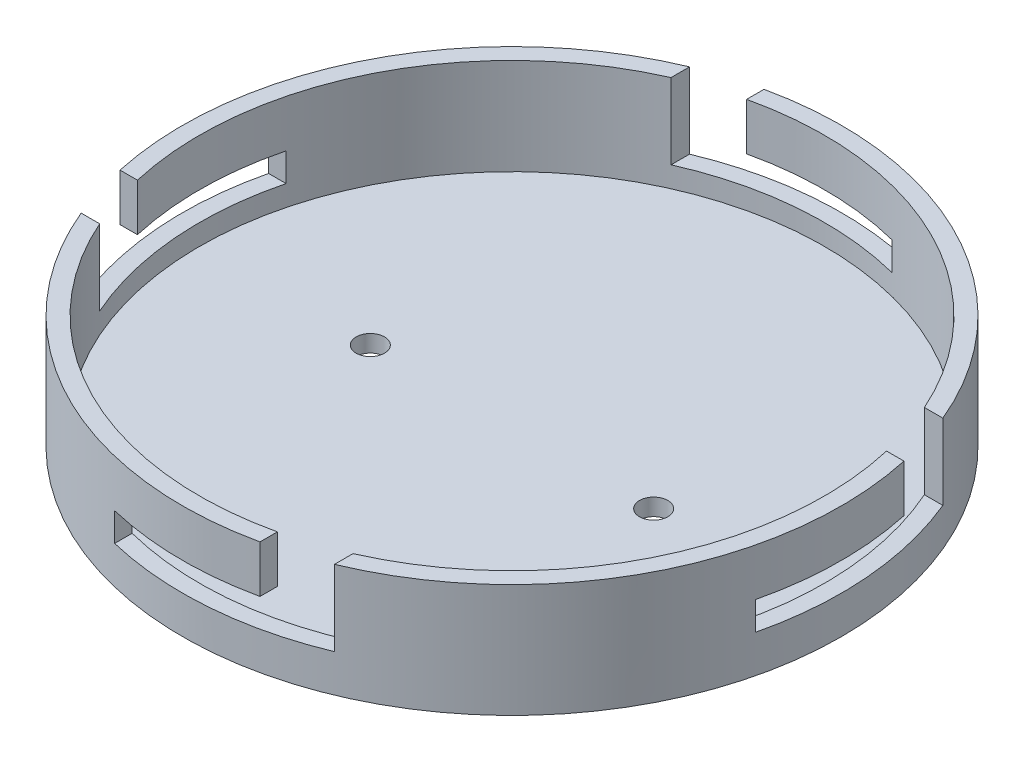
ISO-10303-21;
HEADER;
FILE_DESCRIPTION(('STEP AP214'),'2;1');
FILE_NAME('part.step','',(''),(''),'','','');
FILE_SCHEMA(('AUTOMOTIVE_DESIGN { 1 0 10303 214 1 1 1 1 }'));
ENDSEC;
DATA;
#1=APPLICATION_CONTEXT('core data for automotive mechanical design processes');
#2=APPLICATION_PROTOCOL_DEFINITION('international standard','automotive_design',2000,#1);
#3=PRODUCT_CONTEXT('',#1,'mechanical');
#4=PRODUCT('Part','Part','',(#3));
#5=PRODUCT_RELATED_PRODUCT_CATEGORY('part','',(#4));
#6=PRODUCT_DEFINITION_FORMATION('','',#4);
#7=PRODUCT_DEFINITION_CONTEXT('part definition',#1,'design');
#8=PRODUCT_DEFINITION('design','',#6,#7);
#9=PRODUCT_DEFINITION_SHAPE('','',#8);
#10=(LENGTH_UNIT() NAMED_UNIT(*) SI_UNIT(.MILLI.,.METRE.));
#11=(NAMED_UNIT(*) PLANE_ANGLE_UNIT() SI_UNIT($,.RADIAN.));
#12=(NAMED_UNIT(*) SI_UNIT($,.STERADIAN.) SOLID_ANGLE_UNIT());
#13=UNCERTAINTY_MEASURE_WITH_UNIT(LENGTH_MEASURE(1.E-05),#10,'distance_accuracy_value','');
#14=(GEOMETRIC_REPRESENTATION_CONTEXT(3) GLOBAL_UNCERTAINTY_ASSIGNED_CONTEXT((#13)) GLOBAL_UNIT_ASSIGNED_CONTEXT((#10,
#11,#12)) REPRESENTATION_CONTEXT('',''));
#15=CARTESIAN_POINT('',(0.,0.,0.));
#16=DIRECTION('',(0.,0.,1.));
#17=DIRECTION('',(1.,0.,0.));
#18=AXIS2_PLACEMENT_3D('',#15,#16,#17);
#19=CARTESIAN_POINT('',(0.,20.,0.));
#20=DIRECTION('',(0.,1.,0.));
#21=DIRECTION('',(0.,0.,1.));
#22=AXIS2_PLACEMENT_3D('',#19,#20,#21);
#23=PLANE('',#22);
#24=CARTESIAN_POINT('',(0.,20.,0.));
#25=DIRECTION('',(0.,1.,0.));
#26=DIRECTION('',(1.,0.,0.));
#27=AXIS2_PLACEMENT_3D('',#24,#25,#26);
#28=CIRCLE('',#27,58.1543289325507);
#29=CARTESIAN_POINT('',(53.6880826962519,20.,-22.3498489926829));
#30=VERTEX_POINT('',#29);
#31=CARTESIAN_POINT('',(-12.3498489926827,20.,-56.8278734729115));
#32=VERTEX_POINT('',#31);
#33=EDGE_CURVE('E240',#30,#32,#28,.T.);
#34=ORIENTED_EDGE('',*,*,#33,.T.);
#35=DIRECTION('',(0.,0.,1.));
#36=VECTOR('',#35,1.);
#37=CARTESIAN_POINT('',(-12.3498489926827,20.,-58.154328932551));
#38=LINE('',#37,#36);
#39=CARTESIAN_POINT('',(-12.3498489926827,20.,-53.7538950203419));
#40=VERTEX_POINT('',#39);
#41=EDGE_CURVE('E323',#32,#40,#38,.T.);
#42=ORIENTED_EDGE('',*,*,#41,.T.);
#43=CARTESIAN_POINT('',(0.,20.,0.));
#44=DIRECTION('',(0.,1.,0.));
#45=DIRECTION('',(0.,0.,1.));
#46=AXIS2_PLACEMENT_3D('',#43,#44,#45);
#47=CIRCLE('',#46,55.1543289325507);
#48=CARTESIAN_POINT('',(50.4230527636345,20.,-22.3498489926829));
#49=VERTEX_POINT('',#48);
#50=EDGE_CURVE('E403',#49,#40,#47,.T.);
#51=ORIENTED_EDGE('',*,*,#50,.F.);
#52=DIRECTION('',(-1.,0.,0.));
#53=VECTOR('',#52,1.);
#54=CARTESIAN_POINT('',(58.1543289325507,20.,-22.3498489926829));
#55=LINE('',#54,#53);
#56=EDGE_CURVE('E334',#30,#49,#55,.T.);
#57=ORIENTED_EDGE('',*,*,#56,.F.);
#58=EDGE_LOOP('',(#34,#42,#51,#57));
#59=FACE_BOUND('',#58,.T.);
#60=ADVANCED_FACE('F41',(#59),#23,.T.);
#61=CARTESIAN_POINT('',(22.3498489926823,20.,53.6880826962521));
#62=VERTEX_POINT('',#61);
#63=CARTESIAN_POINT('',(56.8278734729115,20.,-12.3498489926829));
#64=VERTEX_POINT('',#63);
#65=EDGE_CURVE('E233',#62,#64,#28,.T.);
#66=ORIENTED_EDGE('',*,*,#65,.T.);
#67=DIRECTION('',(-1.,0.,0.));
#68=VECTOR('',#67,1.);
#69=CARTESIAN_POINT('',(58.1543289325507,20.,-12.3498489926829));
#70=LINE('',#69,#68);
#71=CARTESIAN_POINT('',(53.7538950203418,20.,-12.3498489926829));
#72=VERTEX_POINT('',#71);
#73=EDGE_CURVE('E336',#64,#72,#70,.T.);
#74=ORIENTED_EDGE('',*,*,#73,.T.);
#75=CARTESIAN_POINT('',(22.3498489926823,20.,50.4230527636348));
#76=VERTEX_POINT('',#75);
#77=EDGE_CURVE('E254',#76,#72,#47,.T.);
#78=ORIENTED_EDGE('',*,*,#77,.F.);
#79=DIRECTION('',(0.,0.,-1.));
#80=VECTOR('',#79,1.);
#81=CARTESIAN_POINT('',(22.3498489926822,20.,58.1543289325516));
#82=LINE('',#81,#80);
#83=EDGE_CURVE('E215',#62,#76,#82,.T.);
#84=ORIENTED_EDGE('',*,*,#83,.F.);
#85=EDGE_LOOP('',(#66,#74,#78,#84));
#86=FACE_BOUND('',#85,.T.);
#87=ADVANCED_FACE('F414',(#86),#23,.T.);
#88=CARTESIAN_POINT('',(-53.6880826962519,20.,22.3498489926829));
#89=VERTEX_POINT('',#88);
#90=CARTESIAN_POINT('',(12.3498489926823,20.,56.8278734729116));
#91=VERTEX_POINT('',#90);
#92=EDGE_CURVE('E223',#89,#91,#28,.T.);
#93=ORIENTED_EDGE('',*,*,#92,.T.);
#94=DIRECTION('',(0.,0.,-1.));
#95=VECTOR('',#94,1.);
#96=CARTESIAN_POINT('',(12.3498489926822,20.,58.1543289325515));
#97=LINE('',#96,#95);
#98=CARTESIAN_POINT('',(12.3498489926823,20.,53.753895020342));
#99=VERTEX_POINT('',#98);
#100=EDGE_CURVE('E203',#91,#99,#97,.T.);
#101=ORIENTED_EDGE('',*,*,#100,.T.);
#102=CARTESIAN_POINT('',(-50.4230527636345,20.,22.3498489926829));
#103=VERTEX_POINT('',#102);
#104=EDGE_CURVE('E251',#103,#99,#47,.T.);
#105=ORIENTED_EDGE('',*,*,#104,.F.);
#106=DIRECTION('',(1.,0.,0.));
#107=VECTOR('',#106,1.);
#108=CARTESIAN_POINT('',(-58.1543289325507,20.,22.3498489926829));
#109=LINE('',#108,#107);
#110=EDGE_CURVE('E231',#89,#103,#109,.T.);
#111=ORIENTED_EDGE('',*,*,#110,.F.);
#112=EDGE_LOOP('',(#93,#101,#105,#111));
#113=FACE_BOUND('',#112,.T.);
#114=ADVANCED_FACE('F230',(#113),#23,.T.);
#115=CARTESIAN_POINT('',(0.,20.,0.));
#116=DIRECTION('',(0.,-1.,0.));
#117=DIRECTION('',(0.,0.,-1.));
#118=AXIS2_PLACEMENT_3D('',#115,#116,#117);
#119=CYLINDRICAL_SURFACE('',#118,58.1543289325507);
#120=CARTESIAN_POINT('',(0.,0.,0.));
#121=DIRECTION('',(0.,1.,0.));
#122=DIRECTION('',(1.,0.,0.));
#123=AXIS2_PLACEMENT_3D('',#120,#121,#122);
#124=CIRCLE('',#123,58.1543289325507);
#125=CARTESIAN_POINT('',(58.1543289325507,0.,0.));
#126=VERTEX_POINT('',#125);
#127=EDGE_CURVE('E243',#126,#126,#124,.T.);
#128=ORIENTED_EDGE('',*,*,#127,.T.);
#129=EDGE_LOOP('',(#128));
#130=FACE_BOUND('',#129,.T.);
#131=CARTESIAN_POINT('',(0.,11.6584784594273,0.));
#132=DIRECTION('',(0.,-1.,0.));
#133=DIRECTION('',(0.,0.,-1.));
#134=AXIS2_PLACEMENT_3D('',#131,#132,#133);
#135=CIRCLE('',#134,58.1543289325507);
#136=CARTESIAN_POINT('',(-12.3498489926827,11.6584784594273,-56.8278734729115));
#137=VERTEX_POINT('',#136);
#138=CARTESIAN_POINT('',(13.5852023288859,11.6584784594273,-56.5452761181563));
#139=VERTEX_POINT('',#138);
#140=EDGE_CURVE('E369',#137,#139,#135,.T.);
#141=ORIENTED_EDGE('',*,*,#140,.F.);
#142=DIRECTION('',(0.,-1.,0.));
#143=VECTOR('',#142,1.);
#144=CARTESIAN_POINT('',(-12.3498489926827,20.,-56.8278734729115));
#145=LINE('',#144,#143);
#146=EDGE_CURVE('E372',#32,#137,#145,.T.);
#147=ORIENTED_EDGE('',*,*,#146,.F.);
#148=ORIENTED_EDGE('',*,*,#33,.F.);
#149=DIRECTION('',(0.,-1.,0.));
#150=VECTOR('',#149,1.);
#151=CARTESIAN_POINT('',(53.6880826962519,20.,-22.3498489926829));
#152=LINE('',#151,#150);
#153=CARTESIAN_POINT('',(53.6880826962519,6.65847845942732,-22.3498489926829));
#154=VERTEX_POINT('',#153);
#155=EDGE_CURVE('E356',#30,#154,#152,.T.);
#156=ORIENTED_EDGE('',*,*,#155,.T.);
#157=CARTESIAN_POINT('',(0.,6.65847845942732,0.));
#158=DIRECTION('',(0.,-1.,0.));
#159=DIRECTION('',(0.,0.,-1.));
#160=AXIS2_PLACEMENT_3D('',#157,#158,#159);
#161=CIRCLE('',#160,58.1543289325507);
#162=CARTESIAN_POINT('',(56.5452761181564,6.65847845942732,13.5852023288857));
#163=VERTEX_POINT('',#162);
#164=EDGE_CURVE('E365',#154,#163,#161,.T.);
#165=ORIENTED_EDGE('',*,*,#164,.T.);
#166=DIRECTION('',(0.,-1.,0.));
#167=VECTOR('',#166,1.);
#168=CARTESIAN_POINT('',(56.5452761181564,20.,13.5852023288857));
#169=LINE('',#168,#167);
#170=CARTESIAN_POINT('',(56.5452761181564,11.6584784594273,13.5852023288857));
#171=VERTEX_POINT('',#170);
#172=EDGE_CURVE('E352',#163,#171,#169,.F.);
#173=ORIENTED_EDGE('',*,*,#172,.T.);
#174=CARTESIAN_POINT('',(56.8278734729115,11.6584784594273,-12.3498489926829));
#175=VERTEX_POINT('',#174);
#176=EDGE_CURVE('E370',#175,#171,#135,.T.);
#177=ORIENTED_EDGE('',*,*,#176,.F.);
#178=DIRECTION('',(0.,-1.,0.));
#179=VECTOR('',#178,1.);
#180=CARTESIAN_POINT('',(56.8278734729115,20.,-12.3498489926829));
#181=LINE('',#180,#179);
#182=EDGE_CURVE('E322',#64,#175,#181,.T.);
#183=ORIENTED_EDGE('',*,*,#182,.F.);
#184=ORIENTED_EDGE('',*,*,#65,.F.);
#185=DIRECTION('',(0.,-1.,0.));
#186=VECTOR('',#185,1.);
#187=CARTESIAN_POINT('',(22.3498489926823,20.,53.6880826962521));
#188=LINE('',#187,#186);
#189=CARTESIAN_POINT('',(22.3498489926823,6.65847845942732,53.6880826962521));
#190=VERTEX_POINT('',#189);
#191=EDGE_CURVE('E226',#62,#190,#188,.T.);
#192=ORIENTED_EDGE('',*,*,#191,.T.);
#193=CARTESIAN_POINT('',(-13.5852023288863,6.65847845942732,56.5452761181562));
#194=VERTEX_POINT('',#193);
#195=EDGE_CURVE('E364',#190,#194,#161,.T.);
#196=ORIENTED_EDGE('',*,*,#195,.T.);
#197=DIRECTION('',(0.,-1.,0.));
#198=VECTOR('',#197,1.);
#199=CARTESIAN_POINT('',(-13.5852023288863,20.,56.5452761181562));
#200=LINE('',#199,#198);
#201=CARTESIAN_POINT('',(-13.5852023288863,11.6584784594273,56.5452761181562));
#202=VERTEX_POINT('',#201);
#203=EDGE_CURVE('E227',#194,#202,#200,.F.);
#204=ORIENTED_EDGE('',*,*,#203,.T.);
#205=CARTESIAN_POINT('',(12.3498489926823,11.6584784594273,56.8278734729116));
#206=VERTEX_POINT('',#205);
#207=EDGE_CURVE('E225',#206,#202,#135,.T.);
#208=ORIENTED_EDGE('',*,*,#207,.F.);
#209=DIRECTION('',(0.,-1.,0.));
#210=VECTOR('',#209,1.);
#211=CARTESIAN_POINT('',(12.3498489926823,20.,56.8278734729116));
#212=LINE('',#211,#210);
#213=EDGE_CURVE('E207',#91,#206,#212,.T.);
#214=ORIENTED_EDGE('',*,*,#213,.F.);
#215=ORIENTED_EDGE('',*,*,#92,.F.);
#216=DIRECTION('',(0.,-1.,0.));
#217=VECTOR('',#216,1.);
#218=CARTESIAN_POINT('',(-53.6880826962519,20.,22.3498489926829));
#219=LINE('',#218,#217);
#220=CARTESIAN_POINT('',(-53.6880826962519,6.65847845942732,22.3498489926829));
#221=VERTEX_POINT('',#220);
#222=EDGE_CURVE('E379',#89,#221,#219,.T.);
#223=ORIENTED_EDGE('',*,*,#222,.T.);
#224=CARTESIAN_POINT('',(0.,6.65847845942732,0.));
#225=DIRECTION('',(0.,-1.,0.));
#226=DIRECTION('',(0.,0.,-1.));
#227=AXIS2_PLACEMENT_3D('',#224,#225,#226);
#228=CIRCLE('',#227,58.1543289325507);
#229=CARTESIAN_POINT('',(-56.5452761181564,6.65847845942732,-13.5852023288857));
#230=VERTEX_POINT('',#229);
#231=EDGE_CURVE('E392',#221,#230,#228,.T.);
#232=ORIENTED_EDGE('',*,*,#231,.T.);
#233=DIRECTION('',(0.,-1.,0.));
#234=VECTOR('',#233,1.);
#235=CARTESIAN_POINT('',(-56.5452761181564,20.,-13.5852023288857));
#236=LINE('',#235,#234);
#237=CARTESIAN_POINT('',(-56.5452761181564,11.6584784594273,-13.5852023288857));
#238=VERTEX_POINT('',#237);
#239=EDGE_CURVE('E394',#230,#238,#236,.F.);
#240=ORIENTED_EDGE('',*,*,#239,.T.);
#241=CARTESIAN_POINT('',(0.,11.6584784594273,0.));
#242=DIRECTION('',(0.,-1.,0.));
#243=DIRECTION('',(0.,0.,-1.));
#244=AXIS2_PLACEMENT_3D('',#241,#242,#243);
#245=CIRCLE('',#244,58.1543289325507);
#246=CARTESIAN_POINT('',(-56.8278734729115,11.6584784594273,12.3498489926829));
#247=VERTEX_POINT('',#246);
#248=EDGE_CURVE('E397',#247,#238,#245,.T.);
#249=ORIENTED_EDGE('',*,*,#248,.F.);
#250=DIRECTION('',(0.,-1.,0.));
#251=VECTOR('',#250,1.);
#252=CARTESIAN_POINT('',(-56.8278734729115,20.,12.3498489926829));
#253=LINE('',#252,#251);
#254=CARTESIAN_POINT('',(-56.8278734729115,20.,12.3498489926829));
#255=VERTEX_POINT('',#254);
#256=EDGE_CURVE('E399',#255,#247,#253,.T.);
#257=ORIENTED_EDGE('',*,*,#256,.F.);
#258=CARTESIAN_POINT('',(-22.3498489926827,20.,-53.6880826962519));
#259=VERTEX_POINT('',#258);
#260=EDGE_CURVE('E235',#259,#255,#28,.T.);
#261=ORIENTED_EDGE('',*,*,#260,.F.);
#262=DIRECTION('',(0.,-1.,0.));
#263=VECTOR('',#262,1.);
#264=CARTESIAN_POINT('',(-22.3498489926827,20.,-53.6880826962519));
#265=LINE('',#264,#263);
#266=CARTESIAN_POINT('',(-22.3498489926827,6.65847845942732,-53.6880826962519));
#267=VERTEX_POINT('',#266);
#268=EDGE_CURVE('E359',#259,#267,#265,.T.);
#269=ORIENTED_EDGE('',*,*,#268,.T.);
#270=CARTESIAN_POINT('',(13.5852023288859,6.65847845942732,-56.5452761181563));
#271=VERTEX_POINT('',#270);
#272=EDGE_CURVE('E362',#267,#271,#161,.T.);
#273=ORIENTED_EDGE('',*,*,#272,.T.);
#274=DIRECTION('',(0.,-1.,0.));
#275=VECTOR('',#274,1.);
#276=CARTESIAN_POINT('',(13.5852023288859,20.,-56.5452761181563));
#277=LINE('',#276,#275);
#278=EDGE_CURVE('E366',#271,#139,#277,.F.);
#279=ORIENTED_EDGE('',*,*,#278,.T.);
#280=EDGE_LOOP('',(#141,#147,#148,#156,#165,#173,#177,#183,#184,#192,#196,#204,#208,#214,#215,
#223,#232,#240,#249,#257,#261,#269,#273,#279));
#281=FACE_BOUND('',#280,.T.);
#282=ADVANCED_FACE('F221',(#130,#281),#119,.T.);
#283=CARTESIAN_POINT('',(0.,20.,0.));
#284=DIRECTION('',(0.,-1.,0.));
#285=DIRECTION('',(0.,0.,-1.));
#286=AXIS2_PLACEMENT_3D('',#283,#284,#285);
#287=CYLINDRICAL_SURFACE('',#286,55.1543289325507);
#288=CARTESIAN_POINT('',(0.,3.,0.));
#289=DIRECTION('',(0.,1.,0.));
#290=DIRECTION('',(0.,0.,1.));
#291=AXIS2_PLACEMENT_3D('',#288,#289,#290);
#292=CIRCLE('',#291,55.1543289325507);
#293=CARTESIAN_POINT('',(0.,3.,55.1543289325507));
#294=VERTEX_POINT('',#293);
#295=EDGE_CURVE('E232',#294,#294,#292,.F.);
#296=ORIENTED_EDGE('',*,*,#295,.T.);
#297=EDGE_LOOP('',(#296));
#298=FACE_BOUND('',#297,.T.);
#299=ORIENTED_EDGE('',*,*,#50,.T.);
#300=DIRECTION('',(0.,-1.,0.));
#301=VECTOR('',#300,1.);
#302=CARTESIAN_POINT('',(-12.3498489926827,20.,-53.7538950203419));
#303=LINE('',#302,#301);
#304=CARTESIAN_POINT('',(-12.3498489926827,11.6584784594273,-53.7538950203419));
#305=VERTEX_POINT('',#304);
#306=EDGE_CURVE('E12',#40,#305,#303,.T.);
#307=ORIENTED_EDGE('',*,*,#306,.T.);
#308=CARTESIAN_POINT('',(0.,11.6584784594273,0.));
#309=DIRECTION('',(0.,-1.,0.));
#310=DIRECTION('',(0.,0.,-1.));
#311=AXIS2_PLACEMENT_3D('',#308,#309,#310);
#312=CIRCLE('',#311,55.1543289325507);
#313=CARTESIAN_POINT('',(13.5852023288859,11.6584784594273,-53.4550491318008));
#314=VERTEX_POINT('',#313);
#315=EDGE_CURVE('E49',#305,#314,#312,.T.);
#316=ORIENTED_EDGE('',*,*,#315,.T.);
#317=DIRECTION('',(0.,-1.,0.));
#318=VECTOR('',#317,1.);
#319=CARTESIAN_POINT('',(13.5852023288859,20.,-53.4550491318008));
#320=LINE('',#319,#318);
#321=CARTESIAN_POINT('',(13.5852023288859,6.65847845942732,-53.4550491318008));
#322=VERTEX_POINT('',#321);
#323=EDGE_CURVE('E289',#322,#314,#320,.F.);
#324=ORIENTED_EDGE('',*,*,#323,.F.);
#325=CARTESIAN_POINT('',(0.,6.65847845942732,0.));
#326=DIRECTION('',(0.,-1.,0.));
#327=DIRECTION('',(0.,0.,-1.));
#328=AXIS2_PLACEMENT_3D('',#325,#326,#327);
#329=CIRCLE('',#328,55.1543289325507);
#330=CARTESIAN_POINT('',(-22.3498489926827,6.65847845942732,-50.4230527636346));
#331=VERTEX_POINT('',#330);
#332=EDGE_CURVE('E273',#331,#322,#329,.T.);
#333=ORIENTED_EDGE('',*,*,#332,.F.);
#334=DIRECTION('',(0.,-1.,0.));
#335=VECTOR('',#334,1.);
#336=CARTESIAN_POINT('',(-22.3498489926827,20.,-50.4230527636346));
#337=LINE('',#336,#335);
#338=CARTESIAN_POINT('',(-22.3498489926827,20.,-50.4230527636346));
#339=VERTEX_POINT('',#338);
#340=EDGE_CURVE('E288',#339,#331,#337,.T.);
#341=ORIENTED_EDGE('',*,*,#340,.F.);
#342=CARTESIAN_POINT('',(-53.7538950203418,20.,12.3498489926829));
#343=VERTEX_POINT('',#342);
#344=EDGE_CURVE('E255',#339,#343,#47,.T.);
#345=ORIENTED_EDGE('',*,*,#344,.T.);
#346=DIRECTION('',(0.,-1.,0.));
#347=VECTOR('',#346,1.);
#348=CARTESIAN_POINT('',(-53.7538950203418,20.,12.3498489926829));
#349=LINE('',#348,#347);
#350=CARTESIAN_POINT('',(-53.7538950203418,11.6584784594273,12.3498489926829));
#351=VERTEX_POINT('',#350);
#352=EDGE_CURVE('E265',#343,#351,#349,.T.);
#353=ORIENTED_EDGE('',*,*,#352,.T.);
#354=CARTESIAN_POINT('',(0.,11.6584784594273,0.));
#355=DIRECTION('',(0.,-1.,0.));
#356=DIRECTION('',(0.,0.,-1.));
#357=AXIS2_PLACEMENT_3D('',#354,#355,#356);
#358=CIRCLE('',#357,55.1543289325507);
#359=CARTESIAN_POINT('',(-53.4550491318008,11.6584784594273,-13.5852023288857));
#360=VERTEX_POINT('',#359);
#361=EDGE_CURVE('E262',#351,#360,#358,.T.);
#362=ORIENTED_EDGE('',*,*,#361,.T.);
#363=DIRECTION('',(0.,-1.,0.));
#364=VECTOR('',#363,1.);
#365=CARTESIAN_POINT('',(-53.4550491318008,20.,-13.5852023288857));
#366=LINE('',#365,#364);
#367=CARTESIAN_POINT('',(-53.4550491318008,6.65847845942732,-13.5852023288857));
#368=VERTEX_POINT('',#367);
#369=EDGE_CURVE('E260',#368,#360,#366,.F.);
#370=ORIENTED_EDGE('',*,*,#369,.F.);
#371=CARTESIAN_POINT('',(0.,6.65847845942732,0.));
#372=DIRECTION('',(0.,-1.,0.));
#373=DIRECTION('',(0.,0.,-1.));
#374=AXIS2_PLACEMENT_3D('',#371,#372,#373);
#375=CIRCLE('',#374,55.1543289325507);
#376=CARTESIAN_POINT('',(-50.4230527636345,6.65847845942732,22.3498489926829));
#377=VERTEX_POINT('',#376);
#378=EDGE_CURVE('E258',#377,#368,#375,.T.);
#379=ORIENTED_EDGE('',*,*,#378,.F.);
#380=DIRECTION('',(0.,-1.,0.));
#381=VECTOR('',#380,1.);
#382=CARTESIAN_POINT('',(-50.4230527636345,20.,22.3498489926829));
#383=LINE('',#382,#381);
#384=EDGE_CURVE('E237',#103,#377,#383,.T.);
#385=ORIENTED_EDGE('',*,*,#384,.F.);
#386=ORIENTED_EDGE('',*,*,#104,.T.);
#387=DIRECTION('',(0.,-1.,0.));
#388=VECTOR('',#387,1.);
#389=CARTESIAN_POINT('',(12.3498489926823,20.,53.753895020342));
#390=LINE('',#389,#388);
#391=CARTESIAN_POINT('',(12.3498489926823,11.6584784594273,53.753895020342));
#392=VERTEX_POINT('',#391);
#393=EDGE_CURVE('E210',#99,#392,#390,.T.);
#394=ORIENTED_EDGE('',*,*,#393,.T.);
#395=CARTESIAN_POINT('',(-13.5852023288862,11.6584784594273,53.4550491318007));
#396=VERTEX_POINT('',#395);
#397=EDGE_CURVE('E272',#392,#396,#312,.T.);
#398=ORIENTED_EDGE('',*,*,#397,.T.);
#399=DIRECTION('',(0.,-1.,0.));
#400=VECTOR('',#399,1.);
#401=CARTESIAN_POINT('',(-13.5852023288862,20.,53.4550491318007));
#402=LINE('',#401,#400);
#403=CARTESIAN_POINT('',(-13.5852023288862,6.65847845942732,53.4550491318007));
#404=VERTEX_POINT('',#403);
#405=EDGE_CURVE('E268',#404,#396,#402,.F.);
#406=ORIENTED_EDGE('',*,*,#405,.F.);
#407=CARTESIAN_POINT('',(22.3498489926823,6.65847845942732,50.4230527636348));
#408=VERTEX_POINT('',#407);
#409=EDGE_CURVE('E270',#408,#404,#329,.T.);
#410=ORIENTED_EDGE('',*,*,#409,.F.);
#411=DIRECTION('',(0.,-1.,0.));
#412=VECTOR('',#411,1.);
#413=CARTESIAN_POINT('',(22.3498489926823,20.,50.4230527636348));
#414=LINE('',#413,#412);
#415=EDGE_CURVE('E279',#76,#408,#414,.T.);
#416=ORIENTED_EDGE('',*,*,#415,.F.);
#417=ORIENTED_EDGE('',*,*,#77,.T.);
#418=DIRECTION('',(0.,-1.,0.));
#419=VECTOR('',#418,1.);
#420=CARTESIAN_POINT('',(53.7538950203418,20.,-12.3498489926829));
#421=LINE('',#420,#419);
#422=CARTESIAN_POINT('',(53.7538950203418,11.6584784594273,-12.3498489926829));
#423=VERTEX_POINT('',#422);
#424=EDGE_CURVE('E283',#72,#423,#421,.T.);
#425=ORIENTED_EDGE('',*,*,#424,.T.);
#426=CARTESIAN_POINT('',(53.4550491318008,11.6584784594273,13.5852023288857));
#427=VERTEX_POINT('',#426);
#428=EDGE_CURVE('E277',#423,#427,#312,.T.);
#429=ORIENTED_EDGE('',*,*,#428,.T.);
#430=DIRECTION('',(0.,-1.,0.));
#431=VECTOR('',#430,1.);
#432=CARTESIAN_POINT('',(53.4550491318008,20.,13.5852023288857));
#433=LINE('',#432,#431);
#434=CARTESIAN_POINT('',(53.4550491318008,6.65847845942732,13.5852023288857));
#435=VERTEX_POINT('',#434);
#436=EDGE_CURVE('E281',#435,#427,#433,.F.);
#437=ORIENTED_EDGE('',*,*,#436,.F.);
#438=CARTESIAN_POINT('',(50.4230527636345,6.65847845942732,-22.3498489926829));
#439=VERTEX_POINT('',#438);
#440=EDGE_CURVE('E274',#439,#435,#329,.T.);
#441=ORIENTED_EDGE('',*,*,#440,.F.);
#442=DIRECTION('',(0.,-1.,0.));
#443=VECTOR('',#442,1.);
#444=CARTESIAN_POINT('',(50.4230527636345,20.,-22.3498489926829));
#445=LINE('',#444,#443);
#446=EDGE_CURVE('E286',#49,#439,#445,.T.);
#447=ORIENTED_EDGE('',*,*,#446,.F.);
#448=EDGE_LOOP('',(#299,#307,#316,#324,#333,#341,#345,#353,#362,#370,#379,#385,#386,#394,#398,
#406,#410,#416,#417,#425,#429,#437,#441,#447));
#449=FACE_BOUND('',#448,.T.);
#450=ADVANCED_FACE('F307',(#298,#449),#287,.F.);
#451=DIRECTION('',(0.,0.,1.));
#452=VECTOR('',#451,1.);
#453=CARTESIAN_POINT('',(-22.3498489926826,20.,-58.154328932551));
#454=LINE('',#453,#452);
#455=EDGE_CURVE('E326',#259,#339,#454,.T.);
#456=ORIENTED_EDGE('',*,*,#455,.F.);
#457=ORIENTED_EDGE('',*,*,#260,.T.);
#458=DIRECTION('',(1.,0.,0.));
#459=VECTOR('',#458,1.);
#460=CARTESIAN_POINT('',(-58.1543289325507,20.,12.3498489926829));
#461=LINE('',#460,#459);
#462=EDGE_CURVE('E375',#255,#343,#461,.T.);
#463=ORIENTED_EDGE('',*,*,#462,.T.);
#464=ORIENTED_EDGE('',*,*,#344,.F.);
#465=EDGE_LOOP('',(#456,#457,#463,#464));
#466=FACE_BOUND('',#465,.T.);
#467=ADVANCED_FACE('F436',(#466),#23,.T.);
#468=CARTESIAN_POINT('',(0.,3.,0.));
#469=DIRECTION('',(0.,1.,0.));
#470=DIRECTION('',(0.,0.,1.));
#471=AXIS2_PLACEMENT_3D('',#468,#469,#470);
#472=PLANE('',#471);
#473=CARTESIAN_POINT('',(-25.,3.,0.));
#474=DIRECTION('',(0.,1.,0.));
#475=DIRECTION('',(0.,0.,1.));
#476=AXIS2_PLACEMENT_3D('',#473,#474,#475);
#477=CIRCLE('',#476,2.5);
#478=CARTESIAN_POINT('',(-25.,3.,2.5));
#479=VERTEX_POINT('',#478);
#480=EDGE_CURVE('E720',#479,#479,#477,.T.);
#481=ORIENTED_EDGE('',*,*,#480,.F.);
#482=EDGE_LOOP('',(#481));
#483=FACE_BOUND('',#482,.T.);
#484=CARTESIAN_POINT('',(25.,3.,0.));
#485=DIRECTION('',(0.,1.,0.));
#486=DIRECTION('',(0.,0.,1.));
#487=AXIS2_PLACEMENT_3D('',#484,#485,#486);
#488=CIRCLE('',#487,2.5);
#489=CARTESIAN_POINT('',(25.,3.,2.5));
#490=VERTEX_POINT('',#489);
#491=EDGE_CURVE('E727',#490,#490,#488,.T.);
#492=ORIENTED_EDGE('',*,*,#491,.F.);
#493=EDGE_LOOP('',(#492));
#494=FACE_BOUND('',#493,.T.);
#495=ORIENTED_EDGE('',*,*,#295,.F.);
#496=EDGE_LOOP('',(#495));
#497=FACE_BOUND('',#496,.T.);
#498=ADVANCED_FACE('F473',(#483,#494,#497),#472,.T.);
#499=CARTESIAN_POINT('',(0.,0.,0.));
#500=DIRECTION('',(0.,1.,0.));
#501=DIRECTION('',(0.,0.,1.));
#502=AXIS2_PLACEMENT_3D('',#499,#500,#501);
#503=PLANE('',#502);
#504=CARTESIAN_POINT('',(-25.,0.,0.));
#505=DIRECTION('',(0.,1.,0.));
#506=DIRECTION('',(0.,0.,1.));
#507=AXIS2_PLACEMENT_3D('',#504,#505,#506);
#508=CIRCLE('',#507,2.5);
#509=CARTESIAN_POINT('',(-25.,0.,2.5));
#510=VERTEX_POINT('',#509);
#511=EDGE_CURVE('E216',#510,#510,#508,.F.);
#512=ORIENTED_EDGE('',*,*,#511,.F.);
#513=EDGE_LOOP('',(#512));
#514=FACE_BOUND('',#513,.T.);
#515=CARTESIAN_POINT('',(25.,0.,0.));
#516=DIRECTION('',(0.,1.,0.));
#517=DIRECTION('',(0.,0.,1.));
#518=AXIS2_PLACEMENT_3D('',#515,#516,#517);
#519=CIRCLE('',#518,2.5);
#520=CARTESIAN_POINT('',(25.,0.,2.5));
#521=VERTEX_POINT('',#520);
#522=EDGE_CURVE('E724',#521,#521,#519,.F.);
#523=ORIENTED_EDGE('',*,*,#522,.F.);
#524=EDGE_LOOP('',(#523));
#525=FACE_BOUND('',#524,.T.);
#526=ORIENTED_EDGE('',*,*,#127,.F.);
#527=EDGE_LOOP('',(#526));
#528=FACE_BOUND('',#527,.T.);
#529=ADVANCED_FACE('F43',(#514,#525,#528),#503,.F.);
#530=CARTESIAN_POINT('',(-58.1543289325507,0.,12.3498489926829));
#531=DIRECTION('',(0.,0.,1.));
#532=DIRECTION('',(0.,-1.,0.));
#533=AXIS2_PLACEMENT_3D('',#530,#531,#532);
#534=PLANE('',#533);
#535=ORIENTED_EDGE('',*,*,#256,.T.);
#536=DIRECTION('',(1.,0.,0.));
#537=VECTOR('',#536,1.);
#538=CARTESIAN_POINT('',(-58.1543289325507,11.6584784594273,12.3498489926829));
#539=LINE('',#538,#537);
#540=EDGE_CURVE('E376',#247,#351,#539,.T.);
#541=ORIENTED_EDGE('',*,*,#540,.T.);
#542=ORIENTED_EDGE('',*,*,#352,.F.);
#543=ORIENTED_EDGE('',*,*,#462,.F.);
#544=EDGE_LOOP('',(#535,#541,#542,#543));
#545=FACE_BOUND('',#544,.T.);
#546=ADVANCED_FACE('F437',(#545),#534,.T.);
#547=CARTESIAN_POINT('',(-58.1543289325507,11.6584784594273,0.));
#548=DIRECTION('',(0.,-1.,0.));
#549=DIRECTION('',(0.,0.,-1.));
#550=AXIS2_PLACEMENT_3D('',#547,#548,#549);
#551=PLANE('',#550);
#552=ORIENTED_EDGE('',*,*,#248,.T.);
#553=DIRECTION('',(1.,0.,0.));
#554=VECTOR('',#553,1.);
#555=CARTESIAN_POINT('',(-58.1543289325507,11.6584784594273,-13.5852023288857));
#556=LINE('',#555,#554);
#557=EDGE_CURVE('E380',#238,#360,#556,.T.);
#558=ORIENTED_EDGE('',*,*,#557,.T.);
#559=ORIENTED_EDGE('',*,*,#361,.F.);
#560=ORIENTED_EDGE('',*,*,#540,.F.);
#561=EDGE_LOOP('',(#552,#558,#559,#560));
#562=FACE_BOUND('',#561,.T.);
#563=ADVANCED_FACE('F442',(#562),#551,.T.);
#564=CARTESIAN_POINT('',(-58.1543289325507,0.,-13.5852023288857));
#565=DIRECTION('',(0.,0.,-1.));
#566=DIRECTION('',(-1.,0.,0.));
#567=AXIS2_PLACEMENT_3D('',#564,#565,#566);
#568=PLANE('',#567);
#569=DIRECTION('',(1.,0.,0.));
#570=VECTOR('',#569,1.);
#571=CARTESIAN_POINT('',(-58.1543289325507,6.65847845942732,-13.5852023288857));
#572=LINE('',#571,#570);
#573=EDGE_CURVE('E383',#230,#368,#572,.T.);
#574=ORIENTED_EDGE('',*,*,#573,.T.);
#575=ORIENTED_EDGE('',*,*,#369,.T.);
#576=ORIENTED_EDGE('',*,*,#557,.F.);
#577=ORIENTED_EDGE('',*,*,#239,.F.);
#578=EDGE_LOOP('',(#574,#575,#576,#577));
#579=FACE_BOUND('',#578,.T.);
#580=ADVANCED_FACE('F444',(#579),#568,.F.);
#581=CARTESIAN_POINT('',(-58.1543289325507,6.65847845942732,0.));
#582=DIRECTION('',(0.,-1.,0.));
#583=DIRECTION('',(0.,0.,-1.));
#584=AXIS2_PLACEMENT_3D('',#581,#582,#583);
#585=PLANE('',#584);
#586=DIRECTION('',(1.,0.,0.));
#587=VECTOR('',#586,1.);
#588=CARTESIAN_POINT('',(-58.1543289325507,6.65847845942732,22.3498489926829));
#589=LINE('',#588,#587);
#590=EDGE_CURVE('E386',#221,#377,#589,.T.);
#591=ORIENTED_EDGE('',*,*,#590,.T.);
#592=ORIENTED_EDGE('',*,*,#378,.T.);
#593=ORIENTED_EDGE('',*,*,#573,.F.);
#594=ORIENTED_EDGE('',*,*,#231,.F.);
#595=EDGE_LOOP('',(#591,#592,#593,#594));
#596=FACE_BOUND('',#595,.T.);
#597=ADVANCED_FACE('F450',(#596),#585,.F.);
#598=CARTESIAN_POINT('',(-58.1543289325507,0.,22.3498489926829));
#599=DIRECTION('',(0.,0.,1.));
#600=DIRECTION('',(1.,0.,0.));
#601=AXIS2_PLACEMENT_3D('',#598,#599,#600);
#602=PLANE('',#601);
#603=ORIENTED_EDGE('',*,*,#110,.T.);
#604=ORIENTED_EDGE('',*,*,#384,.T.);
#605=ORIENTED_EDGE('',*,*,#590,.F.);
#606=ORIENTED_EDGE('',*,*,#222,.F.);
#607=EDGE_LOOP('',(#603,#604,#605,#606));
#608=FACE_BOUND('',#607,.T.);
#609=ADVANCED_FACE('F453',(#608),#602,.F.);
#610=CARTESIAN_POINT('',(-13.5852023288863,0.,58.1543289325512));
#611=DIRECTION('',(-1.,0.,0.));
#612=DIRECTION('',(0.,0.,1.));
#613=AXIS2_PLACEMENT_3D('',#610,#611,#612);
#614=PLANE('',#613);
#615=DIRECTION('',(0.,0.,-1.));
#616=VECTOR('',#615,1.);
#617=CARTESIAN_POINT('',(-13.5852023288863,6.65847845942732,58.1543289325512));
#618=LINE('',#617,#616);
#619=EDGE_CURVE('E64',#194,#404,#618,.T.);
#620=ORIENTED_EDGE('',*,*,#619,.T.);
#621=ORIENTED_EDGE('',*,*,#405,.T.);
#622=DIRECTION('',(0.,0.,-1.));
#623=VECTOR('',#622,1.);
#624=CARTESIAN_POINT('',(-13.5852023288863,11.6584784594273,58.1543289325512));
#625=LINE('',#624,#623);
#626=EDGE_CURVE('E733',#202,#396,#625,.T.);
#627=ORIENTED_EDGE('',*,*,#626,.F.);
#628=ORIENTED_EDGE('',*,*,#203,.F.);
#629=EDGE_LOOP('',(#620,#621,#627,#628));
#630=FACE_BOUND('',#629,.T.);
#631=ADVANCED_FACE('F455',(#630),#614,.F.);
#632=CARTESIAN_POINT('',(22.3498489926822,0.,58.1543289325516));
#633=DIRECTION('',(1.,0.,0.));
#634=DIRECTION('',(0.,0.,-1.));
#635=AXIS2_PLACEMENT_3D('',#632,#633,#634);
#636=PLANE('',#635);
#637=ORIENTED_EDGE('',*,*,#83,.T.);
#638=ORIENTED_EDGE('',*,*,#415,.T.);
#639=DIRECTION('',(0.,0.,-1.));
#640=VECTOR('',#639,1.);
#641=CARTESIAN_POINT('',(22.3498489926822,6.65847845942732,58.1543289325516));
#642=LINE('',#641,#640);
#643=EDGE_CURVE('E737',#190,#408,#642,.T.);
#644=ORIENTED_EDGE('',*,*,#643,.F.);
#645=ORIENTED_EDGE('',*,*,#191,.F.);
#646=EDGE_LOOP('',(#637,#638,#644,#645));
#647=FACE_BOUND('',#646,.T.);
#648=ADVANCED_FACE('F461',(#647),#636,.F.);
#649=CARTESIAN_POINT('',(2.03044754240947E-13,6.65847845942732,-58.1543289325509));
#650=DIRECTION('',(0.,-1.,0.));
#651=DIRECTION('',(0.,0.,-1.));
#652=AXIS2_PLACEMENT_3D('',#649,#650,#651);
#653=PLANE('',#652);
#654=ORIENTED_EDGE('',*,*,#643,.T.);
#655=ORIENTED_EDGE('',*,*,#409,.T.);
#656=ORIENTED_EDGE('',*,*,#619,.F.);
#657=ORIENTED_EDGE('',*,*,#195,.F.);
#658=EDGE_LOOP('',(#654,#655,#656,#657));
#659=FACE_BOUND('',#658,.T.);
#660=ADVANCED_FACE('F514',(#659),#653,.F.);
#661=CARTESIAN_POINT('',(12.3498489926822,0.,58.1543289325515));
#662=DIRECTION('',(1.,0.,0.));
#663=DIRECTION('',(0.,0.,-1.));
#664=AXIS2_PLACEMENT_3D('',#661,#662,#663);
#665=PLANE('',#664);
#666=ORIENTED_EDGE('',*,*,#213,.T.);
#667=DIRECTION('',(0.,0.,-1.));
#668=VECTOR('',#667,1.);
#669=CARTESIAN_POINT('',(12.3498489926822,11.6584784594273,58.1543289325515));
#670=LINE('',#669,#668);
#671=EDGE_CURVE('E338',#206,#392,#670,.T.);
#672=ORIENTED_EDGE('',*,*,#671,.T.);
#673=ORIENTED_EDGE('',*,*,#393,.F.);
#674=ORIENTED_EDGE('',*,*,#100,.F.);
#675=EDGE_LOOP('',(#666,#672,#673,#674));
#676=FACE_BOUND('',#675,.T.);
#677=ADVANCED_FACE('F205',(#676),#665,.T.);
#678=CARTESIAN_POINT('',(2.03044754240947E-13,11.6584784594273,-58.1543289325509));
#679=DIRECTION('',(0.,-1.,0.));
#680=DIRECTION('',(0.,0.,-1.));
#681=AXIS2_PLACEMENT_3D('',#678,#679,#680);
#682=PLANE('',#681);
#683=ORIENTED_EDGE('',*,*,#207,.T.);
#684=ORIENTED_EDGE('',*,*,#626,.T.);
#685=ORIENTED_EDGE('',*,*,#397,.F.);
#686=ORIENTED_EDGE('',*,*,#671,.F.);
#687=EDGE_LOOP('',(#683,#684,#685,#686));
#688=FACE_BOUND('',#687,.T.);
#689=ADVANCED_FACE('F536',(#688),#682,.T.);
#690=CARTESIAN_POINT('',(58.1543289325507,0.,13.5852023288857));
#691=DIRECTION('',(0.,0.,1.));
#692=DIRECTION('',(1.,0.,0.));
#693=AXIS2_PLACEMENT_3D('',#690,#691,#692);
#694=PLANE('',#693);
#695=DIRECTION('',(-1.,0.,0.));
#696=VECTOR('',#695,1.);
#697=CARTESIAN_POINT('',(58.1543289325507,6.65847845942732,13.5852023288857));
#698=LINE('',#697,#696);
#699=EDGE_CURVE('E56',#163,#435,#698,.T.);
#700=ORIENTED_EDGE('',*,*,#699,.T.);
#701=ORIENTED_EDGE('',*,*,#436,.T.);
#702=DIRECTION('',(-1.,0.,0.));
#703=VECTOR('',#702,1.);
#704=CARTESIAN_POINT('',(58.1543289325507,11.6584784594273,13.5852023288857));
#705=LINE('',#704,#703);
#706=EDGE_CURVE('E317',#171,#427,#705,.T.);
#707=ORIENTED_EDGE('',*,*,#706,.F.);
#708=ORIENTED_EDGE('',*,*,#172,.F.);
#709=EDGE_LOOP('',(#700,#701,#707,#708));
#710=FACE_BOUND('',#709,.T.);
#711=ADVANCED_FACE('F416',(#710),#694,.F.);
#712=CARTESIAN_POINT('',(58.1543289325507,0.,-22.3498489926829));
#713=DIRECTION('',(0.,0.,-1.));
#714=DIRECTION('',(-1.,0.,0.));
#715=AXIS2_PLACEMENT_3D('',#712,#713,#714);
#716=PLANE('',#715);
#717=ORIENTED_EDGE('',*,*,#56,.T.);
#718=ORIENTED_EDGE('',*,*,#446,.T.);
#719=DIRECTION('',(-1.,0.,0.));
#720=VECTOR('',#719,1.);
#721=CARTESIAN_POINT('',(58.1543289325507,6.65847845942732,-22.3498489926829));
#722=LINE('',#721,#720);
#723=EDGE_CURVE('E332',#154,#439,#722,.T.);
#724=ORIENTED_EDGE('',*,*,#723,.F.);
#725=ORIENTED_EDGE('',*,*,#155,.F.);
#726=EDGE_LOOP('',(#717,#718,#724,#725));
#727=FACE_BOUND('',#726,.T.);
#728=ADVANCED_FACE('F420',(#727),#716,.F.);
#729=ORIENTED_EDGE('',*,*,#723,.T.);
#730=ORIENTED_EDGE('',*,*,#440,.T.);
#731=ORIENTED_EDGE('',*,*,#699,.F.);
#732=ORIENTED_EDGE('',*,*,#164,.F.);
#733=EDGE_LOOP('',(#729,#730,#731,#732));
#734=FACE_BOUND('',#733,.T.);
#735=ADVANCED_FACE('F417',(#734),#653,.F.);
#736=CARTESIAN_POINT('',(58.1543289325507,0.,-12.3498489926829));
#737=DIRECTION('',(0.,0.,-1.));
#738=DIRECTION('',(0.,1.,0.));
#739=AXIS2_PLACEMENT_3D('',#736,#737,#738);
#740=PLANE('',#739);
#741=ORIENTED_EDGE('',*,*,#182,.T.);
#742=DIRECTION('',(-1.,0.,0.));
#743=VECTOR('',#742,1.);
#744=CARTESIAN_POINT('',(58.1543289325507,11.6584784594273,-12.3498489926829));
#745=LINE('',#744,#743);
#746=EDGE_CURVE('E314',#175,#423,#745,.T.);
#747=ORIENTED_EDGE('',*,*,#746,.T.);
#748=ORIENTED_EDGE('',*,*,#424,.F.);
#749=ORIENTED_EDGE('',*,*,#73,.F.);
#750=EDGE_LOOP('',(#741,#747,#748,#749));
#751=FACE_BOUND('',#750,.T.);
#752=ADVANCED_FACE('F319',(#751),#740,.T.);
#753=ORIENTED_EDGE('',*,*,#176,.T.);
#754=ORIENTED_EDGE('',*,*,#706,.T.);
#755=ORIENTED_EDGE('',*,*,#428,.F.);
#756=ORIENTED_EDGE('',*,*,#746,.F.);
#757=EDGE_LOOP('',(#753,#754,#755,#756));
#758=FACE_BOUND('',#757,.T.);
#759=ADVANCED_FACE('F313',(#758),#682,.T.);
#760=CARTESIAN_POINT('',(-12.3498489926826,0.,-58.154328932551));
#761=DIRECTION('',(-1.,0.,0.));
#762=DIRECTION('',(0.,0.,1.));
#763=AXIS2_PLACEMENT_3D('',#760,#761,#762);
#764=PLANE('',#763);
#765=ORIENTED_EDGE('',*,*,#146,.T.);
#766=DIRECTION('',(0.,0.,1.));
#767=VECTOR('',#766,1.);
#768=CARTESIAN_POINT('',(-12.3498489926827,11.6584784594273,-58.154328932551));
#769=LINE('',#768,#767);
#770=EDGE_CURVE('E339',#137,#305,#769,.T.);
#771=ORIENTED_EDGE('',*,*,#770,.T.);
#772=ORIENTED_EDGE('',*,*,#306,.F.);
#773=ORIENTED_EDGE('',*,*,#41,.F.);
#774=EDGE_LOOP('',(#765,#771,#772,#773));
#775=FACE_BOUND('',#774,.T.);
#776=ADVANCED_FACE('F426',(#775),#764,.T.);
#777=ORIENTED_EDGE('',*,*,#140,.T.);
#778=DIRECTION('',(0.,0.,1.));
#779=VECTOR('',#778,1.);
#780=CARTESIAN_POINT('',(13.5852023288859,11.6584784594273,-58.1543289325509));
#781=LINE('',#780,#779);
#782=EDGE_CURVE('E342',#139,#314,#781,.T.);
#783=ORIENTED_EDGE('',*,*,#782,.T.);
#784=ORIENTED_EDGE('',*,*,#315,.F.);
#785=ORIENTED_EDGE('',*,*,#770,.F.);
#786=EDGE_LOOP('',(#777,#783,#784,#785));
#787=FACE_BOUND('',#786,.T.);
#788=ADVANCED_FACE('F429',(#787),#682,.T.);
#789=CARTESIAN_POINT('',(13.5852023288859,0.,-58.1543289325509));
#790=DIRECTION('',(1.,0.,0.));
#791=DIRECTION('',(0.,0.,-1.));
#792=AXIS2_PLACEMENT_3D('',#789,#790,#791);
#793=PLANE('',#792);
#794=DIRECTION('',(0.,0.,1.));
#795=VECTOR('',#794,1.);
#796=CARTESIAN_POINT('',(13.5852023288859,6.65847845942732,-58.1543289325509));
#797=LINE('',#796,#795);
#798=EDGE_CURVE('E344',#271,#322,#797,.T.);
#799=ORIENTED_EDGE('',*,*,#798,.T.);
#800=ORIENTED_EDGE('',*,*,#323,.T.);
#801=ORIENTED_EDGE('',*,*,#782,.F.);
#802=ORIENTED_EDGE('',*,*,#278,.F.);
#803=EDGE_LOOP('',(#799,#800,#801,#802));
#804=FACE_BOUND('',#803,.T.);
#805=ADVANCED_FACE('F431',(#804),#793,.F.);
#806=ORIENTED_EDGE('',*,*,#272,.F.);
#807=DIRECTION('',(0.,0.,1.));
#808=VECTOR('',#807,1.);
#809=CARTESIAN_POINT('',(-22.3498489926826,6.65847845942732,-58.154328932551));
#810=LINE('',#809,#808);
#811=EDGE_CURVE('E346',#267,#331,#810,.T.);
#812=ORIENTED_EDGE('',*,*,#811,.T.);
#813=ORIENTED_EDGE('',*,*,#332,.T.);
#814=ORIENTED_EDGE('',*,*,#798,.F.);
#815=EDGE_LOOP('',(#806,#812,#813,#814));
#816=FACE_BOUND('',#815,.T.);
#817=ADVANCED_FACE('F433',(#816),#653,.F.);
#818=CARTESIAN_POINT('',(-22.3498489926826,0.,-58.154328932551));
#819=DIRECTION('',(-1.,0.,0.));
#820=DIRECTION('',(0.,0.,1.));
#821=AXIS2_PLACEMENT_3D('',#818,#819,#820);
#822=PLANE('',#821);
#823=ORIENTED_EDGE('',*,*,#455,.T.);
#824=ORIENTED_EDGE('',*,*,#340,.T.);
#825=ORIENTED_EDGE('',*,*,#811,.F.);
#826=ORIENTED_EDGE('',*,*,#268,.F.);
#827=EDGE_LOOP('',(#823,#824,#825,#826));
#828=FACE_BOUND('',#827,.T.);
#829=ADVANCED_FACE('F435',(#828),#822,.F.);
#830=CARTESIAN_POINT('',(25.,-0.00100000000000013,0.));
#831=DIRECTION('',(0.,1.,0.));
#832=DIRECTION('',(0.,0.,1.));
#833=AXIS2_PLACEMENT_3D('',#830,#831,#832);
#834=CYLINDRICAL_SURFACE('',#833,2.5);
#835=ORIENTED_EDGE('',*,*,#491,.T.);
#836=EDGE_LOOP('',(#835));
#837=FACE_BOUND('',#836,.T.);
#838=ORIENTED_EDGE('',*,*,#522,.T.);
#839=EDGE_LOOP('',(#838));
#840=FACE_BOUND('',#839,.T.);
#841=ADVANCED_FACE('F633',(#837,#840),#834,.F.);
#842=CARTESIAN_POINT('',(-25.,-0.00100000000000013,0.));
#843=DIRECTION('',(0.,1.,0.));
#844=DIRECTION('',(0.,0.,1.));
#845=AXIS2_PLACEMENT_3D('',#842,#843,#844);
#846=CYLINDRICAL_SURFACE('',#845,2.5);
#847=ORIENTED_EDGE('',*,*,#480,.T.);
#848=EDGE_LOOP('',(#847));
#849=FACE_BOUND('',#848,.T.);
#850=ORIENTED_EDGE('',*,*,#511,.T.);
#851=EDGE_LOOP('',(#850));
#852=FACE_BOUND('',#851,.T.);
#853=ADVANCED_FACE('F652',(#849,#852),#846,.F.);
#854=CLOSED_SHELL('',(#60,#87,#114,#282,#450,#467,#498,#529,#546,#563,#580,#597,#609,#631,#648,
#660,#677,#689,#711,#728,#735,#752,#759,#776,#788,#805,#817,#829,#841,#853));
#855=MANIFOLD_SOLID_BREP('B2',#854);
#856=ADVANCED_BREP_SHAPE_REPRESENTATION('',(#18,#855),#14);
#857=SHAPE_DEFINITION_REPRESENTATION(#9,#856);
ENDSEC;
END-ISO-10303-21;
